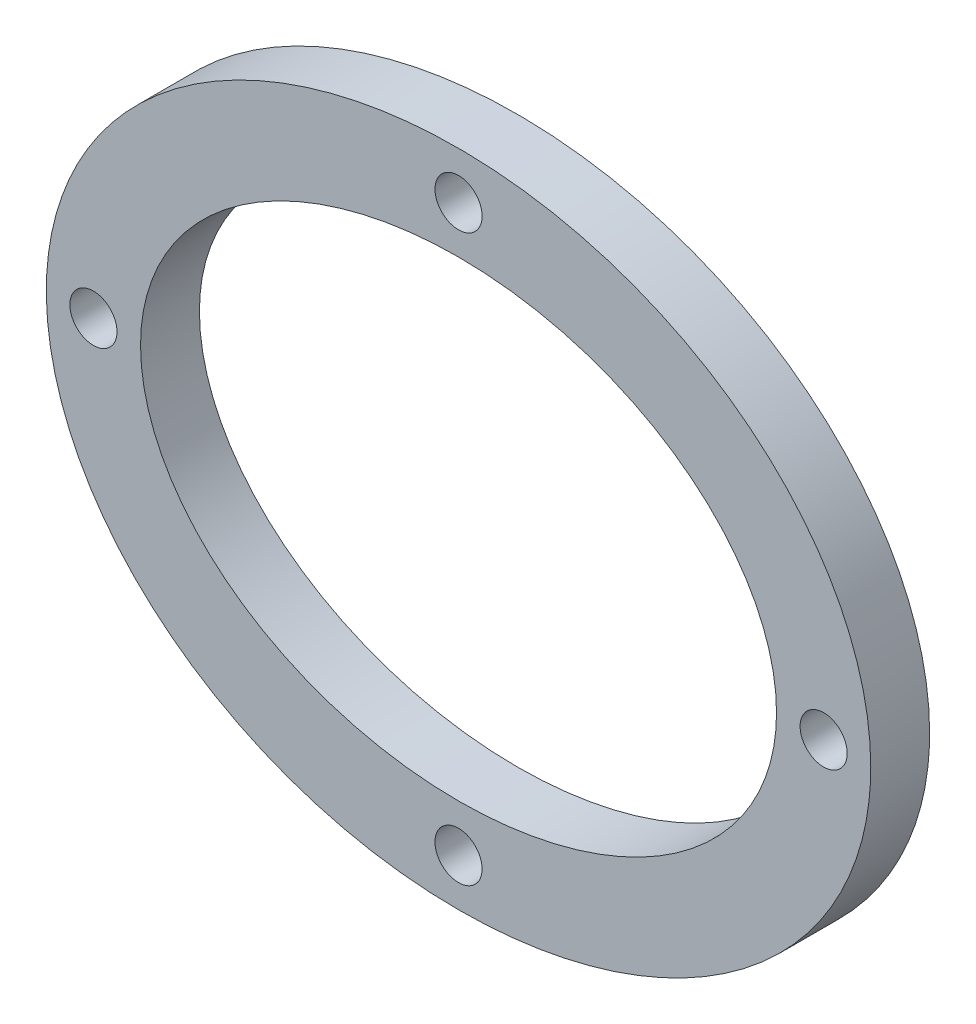
ISO-10303-21;
HEADER;
FILE_DESCRIPTION(('STEP AP214'),'2;1');
FILE_NAME('part.step','',(''),(''),'','','');
FILE_SCHEMA(('AUTOMOTIVE_DESIGN { 1 0 10303 214 1 1 1 1 }'));
ENDSEC;
DATA;
#1=APPLICATION_CONTEXT('core data for automotive mechanical design processes');
#2=APPLICATION_PROTOCOL_DEFINITION('international standard','automotive_design',2000,#1);
#3=PRODUCT_CONTEXT('',#1,'mechanical');
#4=PRODUCT('Part','Part','',(#3));
#5=PRODUCT_RELATED_PRODUCT_CATEGORY('part','',(#4));
#6=PRODUCT_DEFINITION_FORMATION('','',#4);
#7=PRODUCT_DEFINITION_CONTEXT('part definition',#1,'design');
#8=PRODUCT_DEFINITION('design','',#6,#7);
#9=PRODUCT_DEFINITION_SHAPE('','',#8);
#10=(LENGTH_UNIT() NAMED_UNIT(*) SI_UNIT(.MILLI.,.METRE.));
#11=(NAMED_UNIT(*) PLANE_ANGLE_UNIT() SI_UNIT($,.RADIAN.));
#12=(NAMED_UNIT(*) SI_UNIT($,.STERADIAN.) SOLID_ANGLE_UNIT());
#13=UNCERTAINTY_MEASURE_WITH_UNIT(LENGTH_MEASURE(1.E-05),#10,'distance_accuracy_value','');
#14=(GEOMETRIC_REPRESENTATION_CONTEXT(3) GLOBAL_UNCERTAINTY_ASSIGNED_CONTEXT((#13)) GLOBAL_UNIT_ASSIGNED_CONTEXT((#10,
#11,#12)) REPRESENTATION_CONTEXT('',''));
#15=CARTESIAN_POINT('',(0.,0.,0.));
#16=DIRECTION('',(0.,0.,1.));
#17=DIRECTION('',(1.,0.,0.));
#18=AXIS2_PLACEMENT_3D('',#15,#16,#17);
#19=CARTESIAN_POINT('',(0.,0.,5.));
#20=DIRECTION('',(0.,0.,1.));
#21=DIRECTION('',(1.,0.,0.));
#22=AXIS2_PLACEMENT_3D('',#19,#20,#21);
#23=PLANE('',#22);
#24=CARTESIAN_POINT('',(0.,-24.,5.));
#25=DIRECTION('',(0.,0.,1.));
#26=DIRECTION('',(1.,0.,0.));
#27=AXIS2_PLACEMENT_3D('',#24,#25,#26);
#28=CIRCLE('',#27,2.);
#29=CARTESIAN_POINT('',(2.,-24.,5.));
#30=VERTEX_POINT('',#29);
#31=EDGE_CURVE('E101',#30,#30,#28,.T.);
#32=ORIENTED_EDGE('',*,*,#31,.F.);
#33=EDGE_LOOP('',(#32));
#34=FACE_BOUND('',#33,.T.);
#35=CARTESIAN_POINT('',(31.,0.,5.));
#36=DIRECTION('',(0.,0.,1.));
#37=DIRECTION('',(1.,0.,0.));
#38=AXIS2_PLACEMENT_3D('',#35,#36,#37);
#39=CIRCLE('',#38,2.);
#40=CARTESIAN_POINT('',(33.,0.,5.));
#41=VERTEX_POINT('',#40);
#42=EDGE_CURVE('E97',#41,#41,#39,.T.);
#43=ORIENTED_EDGE('',*,*,#42,.F.);
#44=EDGE_LOOP('',(#43));
#45=FACE_BOUND('',#44,.T.);
#46=CARTESIAN_POINT('',(0.,24.,5.));
#47=DIRECTION('',(0.,0.,1.));
#48=DIRECTION('',(1.,0.,0.));
#49=AXIS2_PLACEMENT_3D('',#46,#47,#48);
#50=CIRCLE('',#49,2.);
#51=CARTESIAN_POINT('',(2.,24.,5.));
#52=VERTEX_POINT('',#51);
#53=EDGE_CURVE('E93',#52,#52,#50,.T.);
#54=ORIENTED_EDGE('',*,*,#53,.F.);
#55=EDGE_LOOP('',(#54));
#56=FACE_BOUND('',#55,.T.);
#57=CARTESIAN_POINT('',(-31.,0.,5.));
#58=DIRECTION('',(0.,0.,1.));
#59=DIRECTION('',(1.,0.,0.));
#60=AXIS2_PLACEMENT_3D('',#57,#58,#59);
#61=CIRCLE('',#60,2.);
#62=CARTESIAN_POINT('',(-29.,0.,5.));
#63=VERTEX_POINT('',#62);
#64=EDGE_CURVE('E51',#63,#63,#61,.T.);
#65=ORIENTED_EDGE('',*,*,#64,.F.);
#66=EDGE_LOOP('',(#65));
#67=FACE_BOUND('',#66,.T.);
#68=CARTESIAN_POINT('',(0.,0.,5.));
#69=DIRECTION('',(0.,0.,1.));
#70=DIRECTION('',(1.,0.,0.));
#71=AXIS2_PLACEMENT_3D('',#68,#69,#70);
#72=ELLIPSE('',#71,35.,28.);
#73=CARTESIAN_POINT('',(35.,0.,5.));
#74=VERTEX_POINT('',#73);
#75=EDGE_CURVE('E10',#74,#74,#72,.T.);
#76=ORIENTED_EDGE('',*,*,#75,.T.);
#77=EDGE_LOOP('',(#76));
#78=FACE_BOUND('',#77,.T.);
#79=CARTESIAN_POINT('',(0.,0.,5.));
#80=DIRECTION('',(0.,0.,1.));
#81=DIRECTION('',(1.,0.,0.));
#82=AXIS2_PLACEMENT_3D('',#79,#80,#81);
#83=ELLIPSE('',#82,27.,20.);
#84=CARTESIAN_POINT('',(27.,0.,5.));
#85=VERTEX_POINT('',#84);
#86=EDGE_CURVE('E41',#85,#85,#83,.T.);
#87=ORIENTED_EDGE('',*,*,#86,.F.);
#88=EDGE_LOOP('',(#87));
#89=FACE_BOUND('',#88,.T.);
#90=ADVANCED_FACE('F30',(#34,#45,#56,#67,#78,#89),#23,.T.);
#91=CARTESIAN_POINT('',(0.,0.,0.));
#92=DIRECTION('',(0.,0.,1.));
#93=DIRECTION('',(1.,0.,0.));
#94=AXIS2_PLACEMENT_3D('',#91,#92,#93);
#95=PLANE('',#94);
#96=CARTESIAN_POINT('',(0.,-24.,0.));
#97=DIRECTION('',(0.,0.,1.));
#98=DIRECTION('',(1.,0.,0.));
#99=AXIS2_PLACEMENT_3D('',#96,#97,#98);
#100=CIRCLE('',#99,2.);
#101=CARTESIAN_POINT('',(2.,-24.,0.));
#102=VERTEX_POINT('',#101);
#103=EDGE_CURVE('E73',#102,#102,#100,.T.);
#104=ORIENTED_EDGE('',*,*,#103,.T.);
#105=EDGE_LOOP('',(#104));
#106=FACE_BOUND('',#105,.T.);
#107=CARTESIAN_POINT('',(31.,0.,0.));
#108=DIRECTION('',(0.,0.,1.));
#109=DIRECTION('',(1.,0.,0.));
#110=AXIS2_PLACEMENT_3D('',#107,#108,#109);
#111=CIRCLE('',#110,2.);
#112=CARTESIAN_POINT('',(33.,0.,0.));
#113=VERTEX_POINT('',#112);
#114=EDGE_CURVE('E77',#113,#113,#111,.T.);
#115=ORIENTED_EDGE('',*,*,#114,.T.);
#116=EDGE_LOOP('',(#115));
#117=FACE_BOUND('',#116,.T.);
#118=CARTESIAN_POINT('',(0.,24.,0.));
#119=DIRECTION('',(0.,0.,1.));
#120=DIRECTION('',(1.,0.,0.));
#121=AXIS2_PLACEMENT_3D('',#118,#119,#120);
#122=CIRCLE('',#121,2.);
#123=CARTESIAN_POINT('',(2.,24.,0.));
#124=VERTEX_POINT('',#123);
#125=EDGE_CURVE('E81',#124,#124,#122,.T.);
#126=ORIENTED_EDGE('',*,*,#125,.T.);
#127=EDGE_LOOP('',(#126));
#128=FACE_BOUND('',#127,.T.);
#129=CARTESIAN_POINT('',(-31.,0.,0.));
#130=DIRECTION('',(0.,0.,1.));
#131=DIRECTION('',(1.,0.,0.));
#132=AXIS2_PLACEMENT_3D('',#129,#130,#131);
#133=CIRCLE('',#132,2.);
#134=CARTESIAN_POINT('',(-29.,0.,0.));
#135=VERTEX_POINT('',#134);
#136=EDGE_CURVE('E47',#135,#135,#133,.T.);
#137=ORIENTED_EDGE('',*,*,#136,.T.);
#138=EDGE_LOOP('',(#137));
#139=FACE_BOUND('',#138,.T.);
#140=CARTESIAN_POINT('',(0.,0.,0.));
#141=DIRECTION('',(0.,0.,1.));
#142=DIRECTION('',(1.,0.,0.));
#143=AXIS2_PLACEMENT_3D('',#140,#141,#142);
#144=ELLIPSE('',#143,35.,28.);
#145=CARTESIAN_POINT('',(35.,0.,0.));
#146=VERTEX_POINT('',#145);
#147=EDGE_CURVE('E35',#146,#146,#144,.T.);
#148=ORIENTED_EDGE('',*,*,#147,.F.);
#149=EDGE_LOOP('',(#148));
#150=FACE_BOUND('',#149,.T.);
#151=CARTESIAN_POINT('',(0.,0.,0.));
#152=DIRECTION('',(0.,0.,1.));
#153=DIRECTION('',(1.,0.,0.));
#154=AXIS2_PLACEMENT_3D('',#151,#152,#153);
#155=ELLIPSE('',#154,27.,20.);
#156=CARTESIAN_POINT('',(27.,0.,0.));
#157=VERTEX_POINT('',#156);
#158=EDGE_CURVE('E44',#157,#157,#155,.T.);
#159=ORIENTED_EDGE('',*,*,#158,.T.);
#160=EDGE_LOOP('',(#159));
#161=FACE_BOUND('',#160,.T.);
#162=ADVANCED_FACE('F62',(#106,#117,#128,#139,#150,#161),#95,.F.);
#163=DIRECTION('',(0.,0.,-1.));
#164=VECTOR('',#163,1.);
#165=SURFACE_OF_LINEAR_EXTRUSION('',#72,#164);
#166=ORIENTED_EDGE('',*,*,#75,.F.);
#167=EDGE_LOOP('',(#166));
#168=FACE_BOUND('',#167,.T.);
#169=ORIENTED_EDGE('',*,*,#147,.T.);
#170=EDGE_LOOP('',(#169));
#171=FACE_BOUND('',#170,.T.);
#172=ADVANCED_FACE('F32',(#168,#171),#165,.F.);
#173=DIRECTION('',(0.,0.,-1.));
#174=VECTOR('',#173,1.);
#175=SURFACE_OF_LINEAR_EXTRUSION('',#83,#174);
#176=ORIENTED_EDGE('',*,*,#86,.T.);
#177=EDGE_LOOP('',(#176));
#178=FACE_BOUND('',#177,.T.);
#179=ORIENTED_EDGE('',*,*,#158,.F.);
#180=EDGE_LOOP('',(#179));
#181=FACE_BOUND('',#180,.T.);
#182=ADVANCED_FACE('F54',(#178,#181),#175,.T.);
#183=CARTESIAN_POINT('',(-31.,0.,0.));
#184=DIRECTION('',(0.,0.,1.));
#185=DIRECTION('',(1.,0.,0.));
#186=AXIS2_PLACEMENT_3D('',#183,#184,#185);
#187=CYLINDRICAL_SURFACE('',#186,2.);
#188=ORIENTED_EDGE('',*,*,#136,.F.);
#189=EDGE_LOOP('',(#188));
#190=FACE_BOUND('',#189,.T.);
#191=ORIENTED_EDGE('',*,*,#64,.T.);
#192=EDGE_LOOP('',(#191));
#193=FACE_BOUND('',#192,.T.);
#194=ADVANCED_FACE('F58',(#190,#193),#187,.F.);
#195=CARTESIAN_POINT('',(0.,24.,0.));
#196=DIRECTION('',(0.,0.,1.));
#197=DIRECTION('',(1.,0.,0.));
#198=AXIS2_PLACEMENT_3D('',#195,#196,#197);
#199=CYLINDRICAL_SURFACE('',#198,2.);
#200=ORIENTED_EDGE('',*,*,#125,.F.);
#201=EDGE_LOOP('',(#200));
#202=FACE_BOUND('',#201,.T.);
#203=ORIENTED_EDGE('',*,*,#53,.T.);
#204=EDGE_LOOP('',(#203));
#205=FACE_BOUND('',#204,.T.);
#206=ADVANCED_FACE('F117',(#202,#205),#199,.F.);
#207=CARTESIAN_POINT('',(31.,0.,0.));
#208=DIRECTION('',(0.,0.,1.));
#209=DIRECTION('',(1.,0.,0.));
#210=AXIS2_PLACEMENT_3D('',#207,#208,#209);
#211=CYLINDRICAL_SURFACE('',#210,2.);
#212=ORIENTED_EDGE('',*,*,#114,.F.);
#213=EDGE_LOOP('',(#212));
#214=FACE_BOUND('',#213,.T.);
#215=ORIENTED_EDGE('',*,*,#42,.T.);
#216=EDGE_LOOP('',(#215));
#217=FACE_BOUND('',#216,.T.);
#218=ADVANCED_FACE('F121',(#214,#217),#211,.F.);
#219=CARTESIAN_POINT('',(0.,-24.,0.));
#220=DIRECTION('',(0.,0.,1.));
#221=DIRECTION('',(1.,0.,0.));
#222=AXIS2_PLACEMENT_3D('',#219,#220,#221);
#223=CYLINDRICAL_SURFACE('',#222,2.);
#224=ORIENTED_EDGE('',*,*,#103,.F.);
#225=EDGE_LOOP('',(#224));
#226=FACE_BOUND('',#225,.T.);
#227=ORIENTED_EDGE('',*,*,#31,.T.);
#228=EDGE_LOOP('',(#227));
#229=FACE_BOUND('',#228,.T.);
#230=ADVANCED_FACE('F106',(#226,#229),#223,.F.);
#231=CLOSED_SHELL('',(#90,#162,#172,#182,#194,#206,#218,#230));
#232=MANIFOLD_SOLID_BREP('B2',#231);
#233=ADVANCED_BREP_SHAPE_REPRESENTATION('',(#18,#232),#14);
#234=SHAPE_DEFINITION_REPRESENTATION(#9,#233);
ENDSEC;
END-ISO-10303-21;
